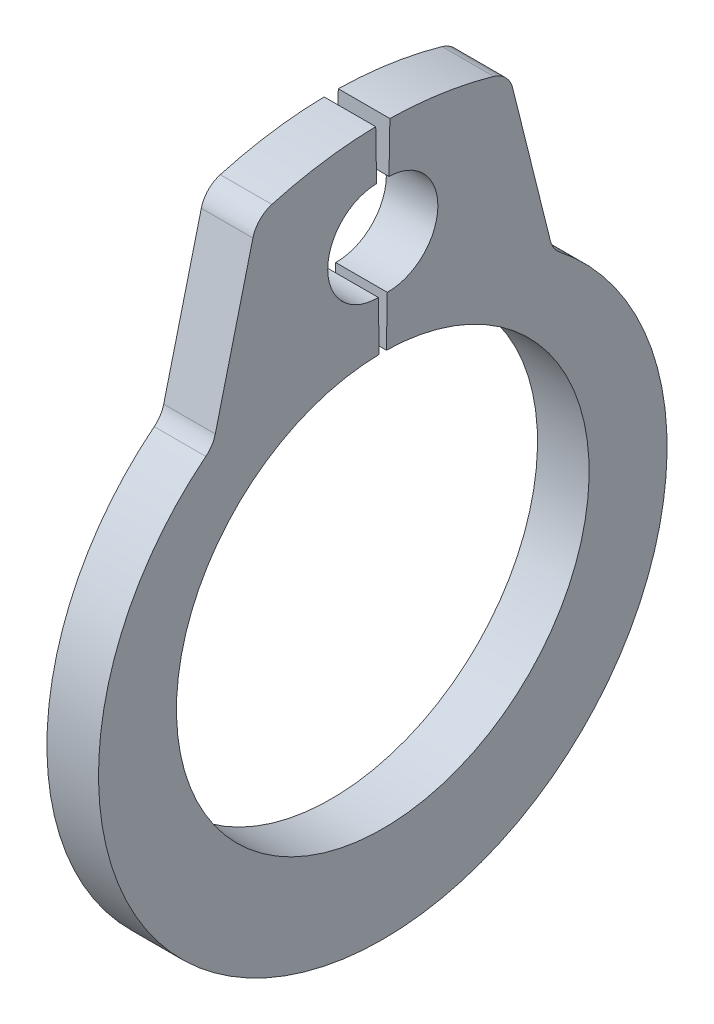
ISO-10303-21;
HEADER;
FILE_DESCRIPTION(('STEP AP214'),'2;1');
FILE_NAME('part.step','',(''),(''),'','','');
FILE_SCHEMA(('AUTOMOTIVE_DESIGN { 1 0 10303 214 1 1 1 1 }'));
ENDSEC;
DATA;
#1=APPLICATION_CONTEXT('core data for automotive mechanical design processes');
#2=APPLICATION_PROTOCOL_DEFINITION('international standard','automotive_design',2000,#1);
#3=PRODUCT_CONTEXT('',#1,'mechanical');
#4=PRODUCT('Part','Part','',(#3));
#5=PRODUCT_RELATED_PRODUCT_CATEGORY('part','',(#4));
#6=PRODUCT_DEFINITION_FORMATION('','',#4);
#7=PRODUCT_DEFINITION_CONTEXT('part definition',#1,'design');
#8=PRODUCT_DEFINITION('design','',#6,#7);
#9=PRODUCT_DEFINITION_SHAPE('','',#8);
#10=(LENGTH_UNIT() NAMED_UNIT(*) SI_UNIT(.MILLI.,.METRE.));
#11=(NAMED_UNIT(*) PLANE_ANGLE_UNIT() SI_UNIT($,.RADIAN.));
#12=(NAMED_UNIT(*) SI_UNIT($,.STERADIAN.) SOLID_ANGLE_UNIT());
#13=UNCERTAINTY_MEASURE_WITH_UNIT(LENGTH_MEASURE(1.E-05),#10,'distance_accuracy_value','');
#14=(GEOMETRIC_REPRESENTATION_CONTEXT(3) GLOBAL_UNCERTAINTY_ASSIGNED_CONTEXT((#13)) GLOBAL_UNIT_ASSIGNED_CONTEXT((#10,
#11,#12)) REPRESENTATION_CONTEXT('',''));
#15=CARTESIAN_POINT('',(0.,0.,0.));
#16=DIRECTION('',(0.,0.,1.));
#17=DIRECTION('',(1.,0.,0.));
#18=AXIS2_PLACEMENT_3D('',#15,#16,#17);
#19=CARTESIAN_POINT('',(0.35,0.,0.));
#20=DIRECTION('',(-1.,0.,0.));
#21=DIRECTION('',(0.,0.,1.));
#22=AXIS2_PLACEMENT_3D('',#19,#20,#21);
#23=CYLINDRICAL_SURFACE('',#22,2.8);
#24=CARTESIAN_POINT('',(-0.35,0.,0.));
#25=DIRECTION('',(-1.,0.,0.));
#26=DIRECTION('',(0.,0.,-1.));
#27=AXIS2_PLACEMENT_3D('',#24,#25,#26);
#28=CIRCLE('',#27,2.8);
#29=CARTESIAN_POINT('',(-0.35,2.79957354643789,-0.0488667380243939));
#30=VERTEX_POINT('',#29);
#31=CARTESIAN_POINT('',(-0.35,2.7995735464379,0.0488667380243939));
#32=VERTEX_POINT('',#31);
#33=EDGE_CURVE('E171',#30,#32,#28,.T.);
#34=ORIENTED_EDGE('',*,*,#33,.T.);
#35=DIRECTION('',(-1.,0.,0.));
#36=VECTOR('',#35,1.);
#37=CARTESIAN_POINT('',(0.35,2.7995735464379,0.0488667380243939));
#38=LINE('',#37,#36);
#39=CARTESIAN_POINT('',(0.35,2.7995735464379,0.0488667380243939));
#40=VERTEX_POINT('',#39);
#41=EDGE_CURVE('E152',#40,#32,#38,.T.);
#42=ORIENTED_EDGE('',*,*,#41,.F.);
#43=CARTESIAN_POINT('',(0.35,0.,0.));
#44=DIRECTION('',(-1.,0.,0.));
#45=DIRECTION('',(0.,0.,-1.));
#46=AXIS2_PLACEMENT_3D('',#43,#44,#45);
#47=CIRCLE('',#46,2.8);
#48=CARTESIAN_POINT('',(0.35,2.79957354643789,-0.0488667380243939));
#49=VERTEX_POINT('',#48);
#50=EDGE_CURVE('E158',#49,#40,#47,.T.);
#51=ORIENTED_EDGE('',*,*,#50,.F.);
#52=DIRECTION('',(-1.,0.,0.));
#53=VECTOR('',#52,1.);
#54=CARTESIAN_POINT('',(0.35,2.79957354643789,-0.0488667380243939));
#55=LINE('',#54,#53);
#56=EDGE_CURVE('E240',#49,#30,#55,.T.);
#57=ORIENTED_EDGE('',*,*,#56,.T.);
#58=EDGE_LOOP('',(#34,#42,#51,#57));
#59=FACE_BOUND('',#58,.T.);
#60=ADVANCED_FACE('F34',(#59),#23,.F.);
#61=CARTESIAN_POINT('',(0.35,3.47447074066846,0.0606471123695604));
#62=DIRECTION('',(0.,-0.0174524064372836,0.999847695156391));
#63=DIRECTION('',(0.,-0.999847695156391,-0.0174524064372836));
#64=AXIS2_PLACEMENT_3D('',#61,#62,#63);
#65=PLANE('',#64);
#66=DIRECTION('',(0.,0.999847695156391,0.0174524064372836));
#67=VECTOR('',#66,1.);
#68=CARTESIAN_POINT('',(-0.35,3.47447074066846,0.0606471123695604));
#69=LINE('',#68,#67);
#70=CARTESIAN_POINT('',(-0.35,3.47447074066846,0.0606471123695604));
#71=VERTEX_POINT('',#70);
#72=EDGE_CURVE('E242',#32,#71,#69,.T.);
#73=ORIENTED_EDGE('',*,*,#72,.T.);
#74=DIRECTION('',(-1.,0.,0.));
#75=VECTOR('',#74,1.);
#76=CARTESIAN_POINT('',(0.35,3.47447074066846,0.0606471123695604));
#77=LINE('',#76,#75);
#78=CARTESIAN_POINT('',(0.35,3.47447074066846,0.0606471123695604));
#79=VERTEX_POINT('',#78);
#80=EDGE_CURVE('E155',#79,#71,#77,.T.);
#81=ORIENTED_EDGE('',*,*,#80,.F.);
#82=DIRECTION('',(0.,0.999847695156391,0.0174524064372836));
#83=VECTOR('',#82,1.);
#84=CARTESIAN_POINT('',(0.35,3.47447074066846,0.0606471123695604));
#85=LINE('',#84,#83);
#86=EDGE_CURVE('E148',#40,#79,#85,.T.);
#87=ORIENTED_EDGE('',*,*,#86,.F.);
#88=ORIENTED_EDGE('',*,*,#41,.T.);
#89=EDGE_LOOP('',(#73,#81,#87,#88));
#90=FACE_BOUND('',#89,.T.);
#91=ADVANCED_FACE('F150',(#90),#65,.F.);
#92=CARTESIAN_POINT('',(0.35,4.14936793489902,0.0724274867147267));
#93=DIRECTION('',(-1.,0.,0.));
#94=DIRECTION('',(0.,0.,1.));
#95=AXIS2_PLACEMENT_3D('',#92,#93,#94);
#96=CYLINDRICAL_SURFACE('',#95,0.675);
#97=CARTESIAN_POINT('',(-0.35,4.14936793489902,0.0724274867147267));
#98=DIRECTION('',(-1.,0.,0.));
#99=DIRECTION('',(0.,0.,1.));
#100=AXIS2_PLACEMENT_3D('',#97,#98,#99);
#101=CIRCLE('',#100,0.675);
#102=CARTESIAN_POINT('',(-0.35,4.82426512912959,0.084207861059893));
#103=VERTEX_POINT('',#102);
#104=EDGE_CURVE('E244',#71,#103,#101,.T.);
#105=ORIENTED_EDGE('',*,*,#104,.T.);
#106=DIRECTION('',(-1.,0.,0.));
#107=VECTOR('',#106,1.);
#108=CARTESIAN_POINT('',(0.35,4.82426512912959,0.084207861059893));
#109=LINE('',#108,#107);
#110=CARTESIAN_POINT('',(0.35,4.82426512912959,0.084207861059893));
#111=VERTEX_POINT('',#110);
#112=EDGE_CURVE('E176',#111,#103,#109,.T.);
#113=ORIENTED_EDGE('',*,*,#112,.F.);
#114=CARTESIAN_POINT('',(0.35,4.14936793489902,0.0724274867147267));
#115=DIRECTION('',(-1.,0.,0.));
#116=DIRECTION('',(0.,0.,1.));
#117=AXIS2_PLACEMENT_3D('',#114,#115,#116);
#118=CIRCLE('',#117,0.675);
#119=EDGE_CURVE('E157',#79,#111,#118,.T.);
#120=ORIENTED_EDGE('',*,*,#119,.F.);
#121=ORIENTED_EDGE('',*,*,#80,.T.);
#122=EDGE_LOOP('',(#105,#113,#120,#121));
#123=FACE_BOUND('',#122,.T.);
#124=ADVANCED_FACE('F302',(#123),#96,.F.);
#125=CARTESIAN_POINT('',(0.35,4.82426512912959,0.0842078610598931));
#126=DIRECTION('',(0.,-0.0174524064372836,0.999847695156391));
#127=DIRECTION('',(0.,-0.999847695156391,-0.0174524064372836));
#128=AXIS2_PLACEMENT_3D('',#125,#126,#127);
#129=PLANE('',#128);
#130=DIRECTION('',(0.,0.999847695156391,0.0174524064372836));
#131=VECTOR('',#130,1.);
#132=CARTESIAN_POINT('',(-0.35,4.82426512912959,0.0842078610598931));
#133=LINE('',#132,#131);
#134=CARTESIAN_POINT('',(-0.35,5.49916232336015,0.0959882354050595));
#135=VERTEX_POINT('',#134);
#136=EDGE_CURVE('E246',#103,#135,#133,.T.);
#137=ORIENTED_EDGE('',*,*,#136,.T.);
#138=DIRECTION('',(-1.,0.,0.));
#139=VECTOR('',#138,1.);
#140=CARTESIAN_POINT('',(0.35,5.49916232336015,0.0959882354050595));
#141=LINE('',#140,#139);
#142=CARTESIAN_POINT('',(0.35,5.49916232336015,0.0959882354050595));
#143=VERTEX_POINT('',#142);
#144=EDGE_CURVE('E271',#143,#135,#141,.T.);
#145=ORIENTED_EDGE('',*,*,#144,.F.);
#146=DIRECTION('',(0.,0.999847695156391,0.0174524064372836));
#147=VECTOR('',#146,1.);
#148=CARTESIAN_POINT('',(0.35,4.82426512912959,0.0842078610598931));
#149=LINE('',#148,#147);
#150=EDGE_CURVE('E280',#111,#143,#149,.T.);
#151=ORIENTED_EDGE('',*,*,#150,.F.);
#152=ORIENTED_EDGE('',*,*,#112,.T.);
#153=EDGE_LOOP('',(#137,#145,#151,#152));
#154=FACE_BOUND('',#153,.T.);
#155=ADVANCED_FACE('F278',(#154),#129,.F.);
#156=CARTESIAN_POINT('',(0.35,0.,0.));
#157=DIRECTION('',(-1.,0.,0.));
#158=DIRECTION('',(0.,0.,1.));
#159=AXIS2_PLACEMENT_3D('',#156,#157,#158);
#160=CYLINDRICAL_SURFACE('',#159,5.5);
#161=CARTESIAN_POINT('',(-0.35,0.,0.));
#162=DIRECTION('',(1.,0.,0.));
#163=DIRECTION('',(0.,0.,-1.));
#164=AXIS2_PLACEMENT_3D('',#161,#162,#163);
#165=CIRCLE('',#164,5.5);
#166=CARTESIAN_POINT('',(-0.35,5.29007973590386,1.50501042779753));
#167=VERTEX_POINT('',#166);
#168=EDGE_CURVE('E248',#135,#167,#165,.T.);
#169=ORIENTED_EDGE('',*,*,#168,.T.);
#170=DIRECTION('',(-1.,0.,0.));
#171=VECTOR('',#170,1.);
#172=CARTESIAN_POINT('',(0.35,5.29007973590386,1.50501042779753));
#173=LINE('',#172,#171);
#174=CARTESIAN_POINT('',(0.35,5.29007973590386,1.50501042779753));
#175=VERTEX_POINT('',#174);
#176=EDGE_CURVE('E191',#167,#175,#173,.F.);
#177=ORIENTED_EDGE('',*,*,#176,.T.);
#178=CARTESIAN_POINT('',(0.35,0.,0.));
#179=DIRECTION('',(1.,0.,0.));
#180=DIRECTION('',(0.,0.,-1.));
#181=AXIS2_PLACEMENT_3D('',#178,#179,#180);
#182=CIRCLE('',#181,5.5);
#183=EDGE_CURVE('E295',#143,#175,#182,.T.);
#184=ORIENTED_EDGE('',*,*,#183,.F.);
#185=ORIENTED_EDGE('',*,*,#144,.T.);
#186=EDGE_LOOP('',(#169,#177,#184,#185));
#187=FACE_BOUND('',#186,.T.);
#188=ADVANCED_FACE('F286',(#187),#160,.T.);
#189=CARTESIAN_POINT('',(0.35,5.22671083370411,1.71216058266742));
#190=DIRECTION('',(0.,-0.241921895599664,-0.970295726275997));
#191=DIRECTION('',(0.,0.970295726275997,-0.241921895599665));
#192=AXIS2_PLACEMENT_3D('',#189,#190,#191);
#193=PLANE('',#192);
#194=DIRECTION('',(0.,-0.970295726275997,0.241921895599664));
#195=VECTOR('',#194,1.);
#196=CARTESIAN_POINT('',(-0.35,5.22671083370411,1.71216058266742));
#197=LINE('',#196,#195);
#198=CARTESIAN_POINT('',(-0.35,5.0237127459513,1.76277369046782));
#199=VERTEX_POINT('',#198);
#200=CARTESIAN_POINT('',(-0.35,2.97721193722231,2.27302364992516));
#201=VERTEX_POINT('',#200);
#202=EDGE_CURVE('E222',#199,#201,#197,.T.);
#203=ORIENTED_EDGE('',*,*,#202,.T.);
#204=DIRECTION('',(1.,0.,0.));
#205=VECTOR('',#204,1.);
#206=CARTESIAN_POINT('',(0.35,2.97721193722231,2.27302364992516));
#207=LINE('',#206,#205);
#208=CARTESIAN_POINT('',(0.35,2.97721193722231,2.27302364992516));
#209=VERTEX_POINT('',#208);
#210=EDGE_CURVE('E185',#201,#209,#207,.T.);
#211=ORIENTED_EDGE('',*,*,#210,.T.);
#212=DIRECTION('',(0.,-0.970295726275997,0.241921895599664));
#213=VECTOR('',#212,1.);
#214=CARTESIAN_POINT('',(0.35,5.22671083370411,1.71216058266742));
#215=LINE('',#214,#213);
#216=CARTESIAN_POINT('',(0.35,5.0237127459513,1.76277369046782));
#217=VERTEX_POINT('',#216);
#218=EDGE_CURVE('E232',#217,#209,#215,.T.);
#219=ORIENTED_EDGE('',*,*,#218,.F.);
#220=DIRECTION('',(-1.,0.,0.));
#221=VECTOR('',#220,1.);
#222=CARTESIAN_POINT('',(0.35,5.0237127459513,1.76277369046782));
#223=LINE('',#222,#221);
#224=EDGE_CURVE('E182',#217,#199,#223,.T.);
#225=ORIENTED_EDGE('',*,*,#224,.T.);
#226=EDGE_LOOP('',(#203,#211,#219,#225));
#227=FACE_BOUND('',#226,.T.);
#228=ADVANCED_FACE('F297',(#227),#193,.F.);
#229=CARTESIAN_POINT('',(0.35,-0.242048945637212,0.));
#230=DIRECTION('',(-1.,0.,0.));
#231=DIRECTION('',(0.,0.,1.));
#232=AXIS2_PLACEMENT_3D('',#229,#230,#231);
#233=CYLINDRICAL_SURFACE('',#232,3.85795105436279);
#234=CARTESIAN_POINT('',(0.35,-0.242048945637212,0.));
#235=DIRECTION('',(1.,0.,0.));
#236=DIRECTION('',(0.,0.,-1.));
#237=AXIS2_PLACEMENT_3D('',#234,#235,#236);
#238=CIRCLE('',#237,3.85795105436279);
#239=CARTESIAN_POINT('',(0.35,2.77716300858808,2.40169638241848));
#240=VERTEX_POINT('',#239);
#241=CARTESIAN_POINT('',(0.35,2.77716300858808,-2.40169638241849));
#242=VERTEX_POINT('',#241);
#243=EDGE_CURVE('E226',#240,#242,#238,.T.);
#244=ORIENTED_EDGE('',*,*,#243,.F.);
#245=DIRECTION('',(-1.,0.,0.));
#246=VECTOR('',#245,1.);
#247=CARTESIAN_POINT('',(0.35,2.77716300858809,2.40169638241848));
#248=LINE('',#247,#246);
#249=CARTESIAN_POINT('',(-0.35,2.77716300858808,2.40169638241848));
#250=VERTEX_POINT('',#249);
#251=EDGE_CURVE('E174',#240,#250,#248,.T.);
#252=ORIENTED_EDGE('',*,*,#251,.T.);
#253=CARTESIAN_POINT('',(-0.35,-0.242048945637212,0.));
#254=DIRECTION('',(1.,0.,0.));
#255=DIRECTION('',(0.,0.,-1.));
#256=AXIS2_PLACEMENT_3D('',#253,#254,#255);
#257=CIRCLE('',#256,3.85795105436279);
#258=CARTESIAN_POINT('',(-0.35,2.77716300858808,-2.40169638241849));
#259=VERTEX_POINT('',#258);
#260=EDGE_CURVE('E212',#250,#259,#257,.T.);
#261=ORIENTED_EDGE('',*,*,#260,.T.);
#262=DIRECTION('',(-1.,0.,0.));
#263=VECTOR('',#262,1.);
#264=CARTESIAN_POINT('',(0.35,2.77716300858808,-2.40169638241849));
#265=LINE('',#264,#263);
#266=EDGE_CURVE('E172',#259,#242,#265,.F.);
#267=ORIENTED_EDGE('',*,*,#266,.T.);
#268=EDGE_LOOP('',(#244,#252,#261,#267));
#269=FACE_BOUND('',#268,.T.);
#270=ADVANCED_FACE('F219',(#269),#233,.T.);
#271=CARTESIAN_POINT('',(0.35,5.22671083370411,-1.71216058266743));
#272=DIRECTION('',(0.,-0.241921895599667,0.970295726275997));
#273=DIRECTION('',(0.,-0.970295726275997,-0.241921895599667));
#274=AXIS2_PLACEMENT_3D('',#271,#272,#273);
#275=PLANE('',#274);
#276=DIRECTION('',(0.,0.970295726275997,0.241921895599667));
#277=VECTOR('',#276,1.);
#278=CARTESIAN_POINT('',(-0.35,5.22671083370411,-1.71216058266743));
#279=LINE('',#278,#277);
#280=CARTESIAN_POINT('',(-0.35,2.9772119372223,-2.27302364992517));
#281=VERTEX_POINT('',#280);
#282=CARTESIAN_POINT('',(-0.35,5.02371274595129,-1.76277369046782));
#283=VERTEX_POINT('',#282);
#284=EDGE_CURVE('E213',#281,#283,#279,.T.);
#285=ORIENTED_EDGE('',*,*,#284,.T.);
#286=DIRECTION('',(-1.,0.,0.));
#287=VECTOR('',#286,1.);
#288=CARTESIAN_POINT('',(0.35,5.02371274595129,-1.76277369046782));
#289=LINE('',#288,#287);
#290=CARTESIAN_POINT('',(0.35,5.02371274595129,-1.76277369046782));
#291=VERTEX_POINT('',#290);
#292=EDGE_CURVE('E57',#283,#291,#289,.F.);
#293=ORIENTED_EDGE('',*,*,#292,.T.);
#294=DIRECTION('',(0.,0.970295726275997,0.241921895599667));
#295=VECTOR('',#294,1.);
#296=CARTESIAN_POINT('',(0.35,5.22671083370411,-1.71216058266743));
#297=LINE('',#296,#295);
#298=CARTESIAN_POINT('',(0.35,2.9772119372223,-2.27302364992517));
#299=VERTEX_POINT('',#298);
#300=EDGE_CURVE('E225',#299,#291,#297,.T.);
#301=ORIENTED_EDGE('',*,*,#300,.F.);
#302=DIRECTION('',(1.,0.,0.));
#303=VECTOR('',#302,1.);
#304=CARTESIAN_POINT('',(-0.35,2.9772119372223,-2.27302364992517));
#305=LINE('',#304,#303);
#306=EDGE_CURVE('E199',#299,#281,#305,.F.);
#307=ORIENTED_EDGE('',*,*,#306,.T.);
#308=EDGE_LOOP('',(#285,#293,#301,#307));
#309=FACE_BOUND('',#308,.T.);
#310=ADVANCED_FACE('F227',(#309),#275,.F.);
#311=CARTESIAN_POINT('',(0.35,0.,0.));
#312=DIRECTION('',(-1.,0.,0.));
#313=DIRECTION('',(0.,0.,1.));
#314=AXIS2_PLACEMENT_3D('',#311,#312,#313);
#315=CYLINDRICAL_SURFACE('',#314,5.49999999999999);
#316=CARTESIAN_POINT('',(0.35,0.,0.));
#317=DIRECTION('',(1.,0.,0.));
#318=DIRECTION('',(0.,0.,1.));
#319=AXIS2_PLACEMENT_3D('',#316,#317,#318);
#320=CIRCLE('',#319,5.49999999999999);
#321=CARTESIAN_POINT('',(0.35,5.29007973590386,-1.50501042779753));
#322=VERTEX_POINT('',#321);
#323=CARTESIAN_POINT('',(0.35,5.49916232336014,-0.0959882354050614));
#324=VERTEX_POINT('',#323);
#325=EDGE_CURVE('E228',#322,#324,#320,.T.);
#326=ORIENTED_EDGE('',*,*,#325,.F.);
#327=DIRECTION('',(-1.,0.,0.));
#328=VECTOR('',#327,1.);
#329=CARTESIAN_POINT('',(0.35,5.29007973590386,-1.50501042779753));
#330=LINE('',#329,#328);
#331=CARTESIAN_POINT('',(-0.35,5.29007973590386,-1.50501042779753));
#332=VERTEX_POINT('',#331);
#333=EDGE_CURVE('E196',#322,#332,#330,.T.);
#334=ORIENTED_EDGE('',*,*,#333,.T.);
#335=CARTESIAN_POINT('',(-0.35,0.,0.));
#336=DIRECTION('',(1.,0.,0.));
#337=DIRECTION('',(0.,0.,1.));
#338=AXIS2_PLACEMENT_3D('',#335,#336,#337);
#339=CIRCLE('',#338,5.49999999999999);
#340=CARTESIAN_POINT('',(-0.35,5.49916232336014,-0.0959882354050614));
#341=VERTEX_POINT('',#340);
#342=EDGE_CURVE('E254',#332,#341,#339,.T.);
#343=ORIENTED_EDGE('',*,*,#342,.T.);
#344=DIRECTION('',(-1.,0.,0.));
#345=VECTOR('',#344,1.);
#346=CARTESIAN_POINT('',(0.35,5.49916232336014,-0.0959882354050614));
#347=LINE('',#346,#345);
#348=EDGE_CURVE('E268',#324,#341,#347,.T.);
#349=ORIENTED_EDGE('',*,*,#348,.F.);
#350=EDGE_LOOP('',(#326,#334,#343,#349));
#351=FACE_BOUND('',#350,.T.);
#352=ADVANCED_FACE('F330',(#351),#315,.T.);
#353=CARTESIAN_POINT('',(0.35,4.82426512912958,-0.0842078610598945));
#354=DIRECTION('',(0.,-0.0174524064372838,-0.999847695156391));
#355=DIRECTION('',(0.,0.999847695156391,-0.0174524064372838));
#356=AXIS2_PLACEMENT_3D('',#353,#354,#355);
#357=PLANE('',#356);
#358=DIRECTION('',(0.,-0.999847695156391,0.0174524064372838));
#359=VECTOR('',#358,1.);
#360=CARTESIAN_POINT('',(-0.35,4.82426512912958,-0.0842078610598945));
#361=LINE('',#360,#359);
#362=CARTESIAN_POINT('',(-0.35,4.82426512912958,-0.0842078610598945));
#363=VERTEX_POINT('',#362);
#364=EDGE_CURVE('E256',#341,#363,#361,.T.);
#365=ORIENTED_EDGE('',*,*,#364,.T.);
#366=DIRECTION('',(-1.,0.,0.));
#367=VECTOR('',#366,1.);
#368=CARTESIAN_POINT('',(0.35,4.82426512912958,-0.0842078610598945));
#369=LINE('',#368,#367);
#370=CARTESIAN_POINT('',(0.35,4.82426512912958,-0.0842078610598945));
#371=VERTEX_POINT('',#370);
#372=EDGE_CURVE('E265',#371,#363,#369,.T.);
#373=ORIENTED_EDGE('',*,*,#372,.F.);
#374=DIRECTION('',(0.,-0.999847695156391,0.0174524064372838));
#375=VECTOR('',#374,1.);
#376=CARTESIAN_POINT('',(0.35,4.82426512912958,-0.0842078610598945));
#377=LINE('',#376,#375);
#378=EDGE_CURVE('E230',#324,#371,#377,.T.);
#379=ORIENTED_EDGE('',*,*,#378,.F.);
#380=ORIENTED_EDGE('',*,*,#348,.T.);
#381=EDGE_LOOP('',(#365,#373,#379,#380));
#382=FACE_BOUND('',#381,.T.);
#383=ADVANCED_FACE('F337',(#382),#357,.F.);
#384=CARTESIAN_POINT('',(0.35,4.14936793489902,-0.0724274867147279));
#385=DIRECTION('',(-1.,0.,0.));
#386=DIRECTION('',(0.,0.,1.));
#387=AXIS2_PLACEMENT_3D('',#384,#385,#386);
#388=CYLINDRICAL_SURFACE('',#387,0.675);
#389=CARTESIAN_POINT('',(-0.35,4.14936793489902,-0.0724274867147279));
#390=DIRECTION('',(-1.,0.,0.));
#391=DIRECTION('',(0.,0.,1.));
#392=AXIS2_PLACEMENT_3D('',#389,#390,#391);
#393=CIRCLE('',#392,0.675);
#394=CARTESIAN_POINT('',(-0.35,3.47447074066846,-0.0606471123695612));
#395=VERTEX_POINT('',#394);
#396=EDGE_CURVE('E258',#363,#395,#393,.T.);
#397=ORIENTED_EDGE('',*,*,#396,.T.);
#398=DIRECTION('',(-1.,0.,0.));
#399=VECTOR('',#398,1.);
#400=CARTESIAN_POINT('',(0.35,3.47447074066846,-0.0606471123695612));
#401=LINE('',#400,#399);
#402=CARTESIAN_POINT('',(0.35,3.47447074066846,-0.0606471123695612));
#403=VERTEX_POINT('',#402);
#404=EDGE_CURVE('E262',#403,#395,#401,.T.);
#405=ORIENTED_EDGE('',*,*,#404,.F.);
#406=CARTESIAN_POINT('',(0.35,4.14936793489902,-0.0724274867147279));
#407=DIRECTION('',(-1.,0.,0.));
#408=DIRECTION('',(0.,0.,1.));
#409=AXIS2_PLACEMENT_3D('',#406,#407,#408);
#410=CIRCLE('',#409,0.675);
#411=EDGE_CURVE('E237',#371,#403,#410,.T.);
#412=ORIENTED_EDGE('',*,*,#411,.F.);
#413=ORIENTED_EDGE('',*,*,#372,.T.);
#414=EDGE_LOOP('',(#397,#405,#412,#413));
#415=FACE_BOUND('',#414,.T.);
#416=ADVANCED_FACE('F341',(#415),#388,.F.);
#417=CARTESIAN_POINT('',(0.35,2.79957354643789,-0.0488667380243939));
#418=DIRECTION('',(0.,-0.0174524064372851,-0.999847695156391));
#419=DIRECTION('',(0.,0.999847695156391,-0.0174524064372851));
#420=AXIS2_PLACEMENT_3D('',#417,#418,#419);
#421=PLANE('',#420);
#422=DIRECTION('',(0.,-0.999847695156391,0.0174524064372851));
#423=VECTOR('',#422,1.);
#424=CARTESIAN_POINT('',(-0.35,2.79957354643789,-0.0488667380243939));
#425=LINE('',#424,#423);
#426=EDGE_CURVE('E168',#395,#30,#425,.T.);
#427=ORIENTED_EDGE('',*,*,#426,.T.);
#428=ORIENTED_EDGE('',*,*,#56,.F.);
#429=DIRECTION('',(0.,-0.999847695156391,0.0174524064372851));
#430=VECTOR('',#429,1.);
#431=CARTESIAN_POINT('',(0.35,2.79957354643789,-0.0488667380243939));
#432=LINE('',#431,#430);
#433=EDGE_CURVE('E164',#403,#49,#432,.T.);
#434=ORIENTED_EDGE('',*,*,#433,.F.);
#435=ORIENTED_EDGE('',*,*,#404,.T.);
#436=EDGE_LOOP('',(#427,#428,#434,#435));
#437=FACE_BOUND('',#436,.T.);
#438=ADVANCED_FACE('F344',(#437),#421,.F.);
#439=CARTESIAN_POINT('',(0.35,0.,0.));
#440=DIRECTION('',(1.,0.,0.));
#441=DIRECTION('',(0.,0.,-1.));
#442=AXIS2_PLACEMENT_3D('',#439,#440,#441);
#443=PLANE('',#442);
#444=ORIENTED_EDGE('',*,*,#183,.T.);
#445=CARTESIAN_POINT('',(0.35,4.93420164457942,1.4037642717457));
#446=DIRECTION('',(1.,0.,0.));
#447=DIRECTION('',(0.,0.,-1.));
#448=AXIS2_PLACEMENT_3D('',#445,#446,#447);
#449=CIRCLE('',#448,0.37);
#450=EDGE_CURVE('E194',#175,#217,#449,.T.);
#451=ORIENTED_EDGE('',*,*,#450,.T.);
#452=ORIENTED_EDGE('',*,*,#218,.T.);
#453=CARTESIAN_POINT('',(0.35,3.06672303859419,2.63203306864728));
#454=DIRECTION('',(1.,0.,0.));
#455=DIRECTION('',(0.,0.,-1.));
#456=AXIS2_PLACEMENT_3D('',#453,#454,#455);
#457=CIRCLE('',#456,0.37);
#458=EDGE_CURVE('E205',#209,#240,#457,.F.);
#459=ORIENTED_EDGE('',*,*,#458,.T.);
#460=ORIENTED_EDGE('',*,*,#243,.T.);
#461=CARTESIAN_POINT('',(0.35,3.06672303859418,-2.63203306864729));
#462=DIRECTION('',(1.,0.,0.));
#463=DIRECTION('',(0.,0.,-1.));
#464=AXIS2_PLACEMENT_3D('',#461,#462,#463);
#465=CIRCLE('',#464,0.37);
#466=EDGE_CURVE('E11',#242,#299,#465,.F.);
#467=ORIENTED_EDGE('',*,*,#466,.T.);
#468=ORIENTED_EDGE('',*,*,#300,.T.);
#469=CARTESIAN_POINT('',(0.35,4.93420164457942,-1.4037642717457));
#470=DIRECTION('',(1.,0.,0.));
#471=DIRECTION('',(0.,0.,-1.));
#472=AXIS2_PLACEMENT_3D('',#469,#470,#471);
#473=CIRCLE('',#472,0.37);
#474=EDGE_CURVE('E49',#291,#322,#473,.T.);
#475=ORIENTED_EDGE('',*,*,#474,.T.);
#476=ORIENTED_EDGE('',*,*,#325,.T.);
#477=ORIENTED_EDGE('',*,*,#378,.T.);
#478=ORIENTED_EDGE('',*,*,#411,.T.);
#479=ORIENTED_EDGE('',*,*,#433,.T.);
#480=ORIENTED_EDGE('',*,*,#50,.T.);
#481=ORIENTED_EDGE('',*,*,#86,.T.);
#482=ORIENTED_EDGE('',*,*,#119,.T.);
#483=ORIENTED_EDGE('',*,*,#150,.T.);
#484=EDGE_LOOP('',(#444,#451,#452,#459,#460,#467,#468,#475,#476,#477,#478,#479,#480,#481,#482,#483));
#485=FACE_BOUND('',#484,.T.);
#486=ADVANCED_FACE('F162',(#485),#443,.T.);
#487=CARTESIAN_POINT('',(-0.35,0.,0.));
#488=DIRECTION('',(1.,0.,0.));
#489=DIRECTION('',(0.,0.,-1.));
#490=AXIS2_PLACEMENT_3D('',#487,#488,#489);
#491=PLANE('',#490);
#492=ORIENTED_EDGE('',*,*,#202,.F.);
#493=CARTESIAN_POINT('',(-0.35,4.93420164457942,1.4037642717457));
#494=DIRECTION('',(1.,0.,0.));
#495=DIRECTION('',(0.,0.,-1.));
#496=AXIS2_PLACEMENT_3D('',#493,#494,#495);
#497=CIRCLE('',#496,0.37);
#498=EDGE_CURVE('E189',#199,#167,#497,.F.);
#499=ORIENTED_EDGE('',*,*,#498,.T.);
#500=ORIENTED_EDGE('',*,*,#168,.F.);
#501=ORIENTED_EDGE('',*,*,#136,.F.);
#502=ORIENTED_EDGE('',*,*,#104,.F.);
#503=ORIENTED_EDGE('',*,*,#72,.F.);
#504=ORIENTED_EDGE('',*,*,#33,.F.);
#505=ORIENTED_EDGE('',*,*,#426,.F.);
#506=ORIENTED_EDGE('',*,*,#396,.F.);
#507=ORIENTED_EDGE('',*,*,#364,.F.);
#508=ORIENTED_EDGE('',*,*,#342,.F.);
#509=CARTESIAN_POINT('',(-0.35,4.93420164457942,-1.4037642717457));
#510=DIRECTION('',(1.,0.,0.));
#511=DIRECTION('',(0.,0.,-1.));
#512=AXIS2_PLACEMENT_3D('',#509,#510,#511);
#513=CIRCLE('',#512,0.37);
#514=EDGE_CURVE('E187',#332,#283,#513,.F.);
#515=ORIENTED_EDGE('',*,*,#514,.T.);
#516=ORIENTED_EDGE('',*,*,#284,.F.);
#517=CARTESIAN_POINT('',(-0.35,3.06672303859418,-2.63203306864729));
#518=DIRECTION('',(1.,0.,0.));
#519=DIRECTION('',(0.,0.,-1.));
#520=AXIS2_PLACEMENT_3D('',#517,#518,#519);
#521=CIRCLE('',#520,0.37);
#522=EDGE_CURVE('E42',#281,#259,#521,.T.);
#523=ORIENTED_EDGE('',*,*,#522,.T.);
#524=ORIENTED_EDGE('',*,*,#260,.F.);
#525=CARTESIAN_POINT('',(-0.35,3.06672303859419,2.63203306864728));
#526=DIRECTION('',(1.,0.,0.));
#527=DIRECTION('',(0.,0.,-1.));
#528=AXIS2_PLACEMENT_3D('',#525,#526,#527);
#529=CIRCLE('',#528,0.37);
#530=EDGE_CURVE('E203',#250,#201,#529,.T.);
#531=ORIENTED_EDGE('',*,*,#530,.T.);
#532=EDGE_LOOP('',(#492,#499,#500,#501,#502,#503,#504,#505,#506,#507,#508,#515,#516,#523,#524,#531));
#533=FACE_BOUND('',#532,.T.);
#534=ADVANCED_FACE('F211',(#533),#491,.F.);
#535=CARTESIAN_POINT('',(0.35,3.06672303859419,2.63203306864728));
#536=DIRECTION('',(-1.,0.,0.));
#537=DIRECTION('',(0.,0.,1.));
#538=AXIS2_PLACEMENT_3D('',#535,#536,#537);
#539=CYLINDRICAL_SURFACE('',#538,0.37);
#540=ORIENTED_EDGE('',*,*,#458,.F.);
#541=ORIENTED_EDGE('',*,*,#210,.F.);
#542=ORIENTED_EDGE('',*,*,#530,.F.);
#543=ORIENTED_EDGE('',*,*,#251,.F.);
#544=EDGE_LOOP('',(#540,#541,#542,#543));
#545=FACE_BOUND('',#544,.T.);
#546=ADVANCED_FACE('F316',(#545),#539,.F.);
#547=CARTESIAN_POINT('',(0.35,4.93420164457942,1.4037642717457));
#548=DIRECTION('',(-1.,0.,0.));
#549=DIRECTION('',(0.,0.,1.));
#550=AXIS2_PLACEMENT_3D('',#547,#548,#549);
#551=CYLINDRICAL_SURFACE('',#550,0.37);
#552=ORIENTED_EDGE('',*,*,#450,.F.);
#553=ORIENTED_EDGE('',*,*,#176,.F.);
#554=ORIENTED_EDGE('',*,*,#498,.F.);
#555=ORIENTED_EDGE('',*,*,#224,.F.);
#556=EDGE_LOOP('',(#552,#553,#554,#555));
#557=FACE_BOUND('',#556,.T.);
#558=ADVANCED_FACE('F290',(#557),#551,.T.);
#559=CARTESIAN_POINT('',(0.35,4.93420164457942,-1.4037642717457));
#560=DIRECTION('',(-1.,0.,0.));
#561=DIRECTION('',(0.,0.,1.));
#562=AXIS2_PLACEMENT_3D('',#559,#560,#561);
#563=CYLINDRICAL_SURFACE('',#562,0.37);
#564=ORIENTED_EDGE('',*,*,#474,.F.);
#565=ORIENTED_EDGE('',*,*,#292,.F.);
#566=ORIENTED_EDGE('',*,*,#514,.F.);
#567=ORIENTED_EDGE('',*,*,#333,.F.);
#568=EDGE_LOOP('',(#564,#565,#566,#567));
#569=FACE_BOUND('',#568,.T.);
#570=ADVANCED_FACE('F321',(#569),#563,.T.);
#571=CARTESIAN_POINT('',(0.35,3.06672303859418,-2.63203306864729));
#572=DIRECTION('',(-1.,0.,0.));
#573=DIRECTION('',(0.,0.,1.));
#574=AXIS2_PLACEMENT_3D('',#571,#572,#573);
#575=CYLINDRICAL_SURFACE('',#574,0.37);
#576=ORIENTED_EDGE('',*,*,#466,.F.);
#577=ORIENTED_EDGE('',*,*,#266,.F.);
#578=ORIENTED_EDGE('',*,*,#522,.F.);
#579=ORIENTED_EDGE('',*,*,#306,.F.);
#580=EDGE_LOOP('',(#576,#577,#578,#579));
#581=FACE_BOUND('',#580,.T.);
#582=ADVANCED_FACE('F36',(#581),#575,.F.);
#583=CLOSED_SHELL('',(#60,#91,#124,#155,#188,#228,#270,#310,#352,#383,#416,#438,#486,#534,#546,
#558,#570,#582));
#584=MANIFOLD_SOLID_BREP('B2',#583);
#585=ADVANCED_BREP_SHAPE_REPRESENTATION('',(#18,#584),#14);
#586=SHAPE_DEFINITION_REPRESENTATION(#9,#585);
ENDSEC;
END-ISO-10303-21;
